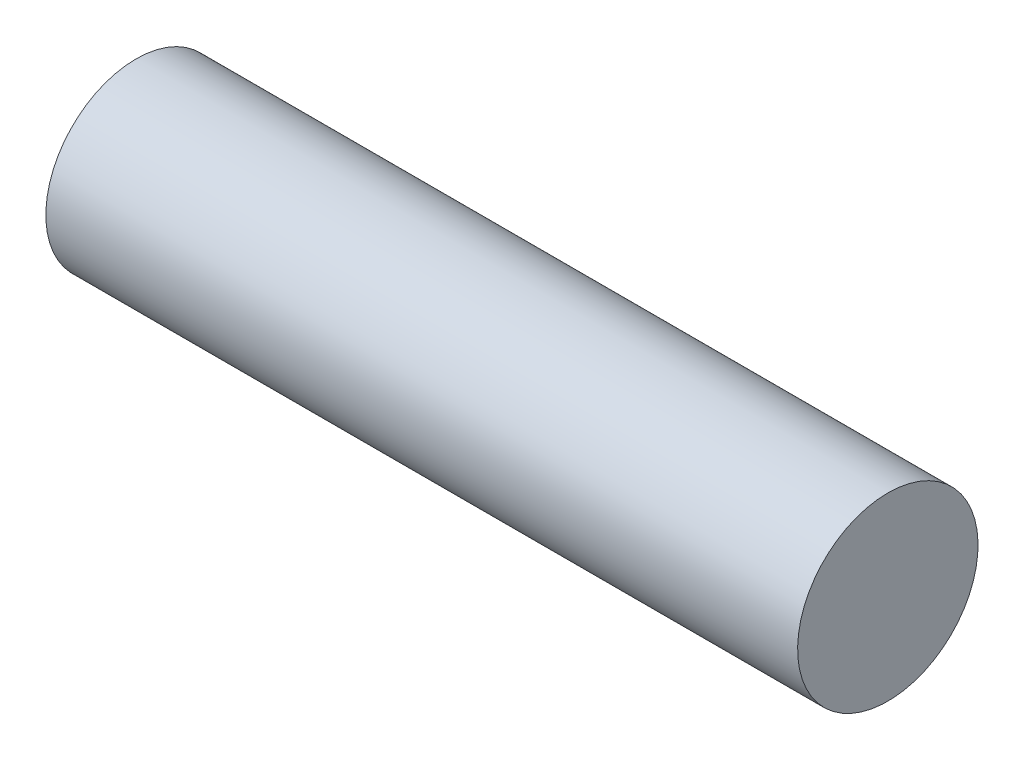
ISO-10303-21;
HEADER;
FILE_DESCRIPTION(('STEP AP214'),'2;1');
FILE_NAME('part.step','',(''),(''),'','','');
FILE_SCHEMA(('AUTOMOTIVE_DESIGN { 1 0 10303 214 1 1 1 1 }'));
ENDSEC;
DATA;
#1=APPLICATION_CONTEXT('core data for automotive mechanical design processes');
#2=APPLICATION_PROTOCOL_DEFINITION('international standard','automotive_design',2000,#1);
#3=PRODUCT_CONTEXT('',#1,'mechanical');
#4=PRODUCT('Part','Part','',(#3));
#5=PRODUCT_RELATED_PRODUCT_CATEGORY('part','',(#4));
#6=PRODUCT_DEFINITION_FORMATION('','',#4);
#7=PRODUCT_DEFINITION_CONTEXT('part definition',#1,'design');
#8=PRODUCT_DEFINITION('design','',#6,#7);
#9=PRODUCT_DEFINITION_SHAPE('','',#8);
#10=(LENGTH_UNIT() NAMED_UNIT(*) SI_UNIT(.MILLI.,.METRE.));
#11=(NAMED_UNIT(*) PLANE_ANGLE_UNIT() SI_UNIT($,.RADIAN.));
#12=(NAMED_UNIT(*) SI_UNIT($,.STERADIAN.) SOLID_ANGLE_UNIT());
#13=UNCERTAINTY_MEASURE_WITH_UNIT(LENGTH_MEASURE(1.E-05),#10,'distance_accuracy_value','');
#14=(GEOMETRIC_REPRESENTATION_CONTEXT(3) GLOBAL_UNCERTAINTY_ASSIGNED_CONTEXT((#13)) GLOBAL_UNIT_ASSIGNED_CONTEXT((#10,
#11,#12)) REPRESENTATION_CONTEXT('',''));
#15=CARTESIAN_POINT('',(0.,0.,0.));
#16=DIRECTION('',(0.,0.,1.));
#17=DIRECTION('',(1.,0.,0.));
#18=AXIS2_PLACEMENT_3D('',#15,#16,#17);
#19=CARTESIAN_POINT('',(105.7,-33.,0.));
#20=DIRECTION('',(-1.,0.,0.));
#21=DIRECTION('',(0.,-1.,0.));
#22=AXIS2_PLACEMENT_3D('',#19,#20,#21);
#23=PLANE('',#22);
#24=CARTESIAN_POINT('',(105.7,-21.535,115.));
#25=DIRECTION('',(1.,0.,0.));
#26=DIRECTION('',(0.,1.,0.));
#27=AXIS2_PLACEMENT_3D('',#24,#25,#26);
#28=CIRCLE('',#27,6.);
#29=CARTESIAN_POINT('',(105.7,-15.535,115.));
#30=VERTEX_POINT('',#29);
#31=EDGE_CURVE('E33',#30,#30,#28,.F.);
#32=ORIENTED_EDGE('',*,*,#31,.F.);
#33=EDGE_LOOP('',(#32));
#34=FACE_BOUND('',#33,.T.);
#35=ADVANCED_FACE('F30',(#34),#23,.F.);
#36=CARTESIAN_POINT('',(55.7,-21.5349999999999,115.));
#37=DIRECTION('',(-1.,0.,0.));
#38=DIRECTION('',(0.,-1.,0.));
#39=AXIS2_PLACEMENT_3D('',#36,#37,#38);
#40=PLANE('',#39);
#41=CARTESIAN_POINT('',(55.7,-21.5349999999999,115.));
#42=DIRECTION('',(-1.,0.,0.));
#43=DIRECTION('',(0.,-1.,0.));
#44=AXIS2_PLACEMENT_3D('',#41,#42,#43);
#45=CIRCLE('',#44,6.);
#46=CARTESIAN_POINT('',(55.7,-27.5349999999999,115.));
#47=VERTEX_POINT('',#46);
#48=EDGE_CURVE('E10',#47,#47,#45,.T.);
#49=ORIENTED_EDGE('',*,*,#48,.T.);
#50=EDGE_LOOP('',(#49));
#51=FACE_BOUND('',#50,.T.);
#52=ADVANCED_FACE('F45',(#51),#40,.T.);
#53=CARTESIAN_POINT('',(55.7,-21.5349999999999,115.));
#54=DIRECTION('',(1.,0.,0.));
#55=DIRECTION('',(0.,1.,0.));
#56=AXIS2_PLACEMENT_3D('',#53,#54,#55);
#57=CYLINDRICAL_SURFACE('',#56,6.);
#58=ORIENTED_EDGE('',*,*,#48,.F.);
#59=EDGE_LOOP('',(#58));
#60=FACE_BOUND('',#59,.T.);
#61=ORIENTED_EDGE('',*,*,#31,.T.);
#62=EDGE_LOOP('',(#61));
#63=FACE_BOUND('',#62,.T.);
#64=ADVANCED_FACE('F42',(#60,#63),#57,.T.);
#65=CLOSED_SHELL('',(#35,#52,#64));
#66=MANIFOLD_SOLID_BREP('B2',#65);
#67=ADVANCED_BREP_SHAPE_REPRESENTATION('',(#18,#66),#14);
#68=SHAPE_DEFINITION_REPRESENTATION(#9,#67);
ENDSEC;
END-ISO-10303-21;
